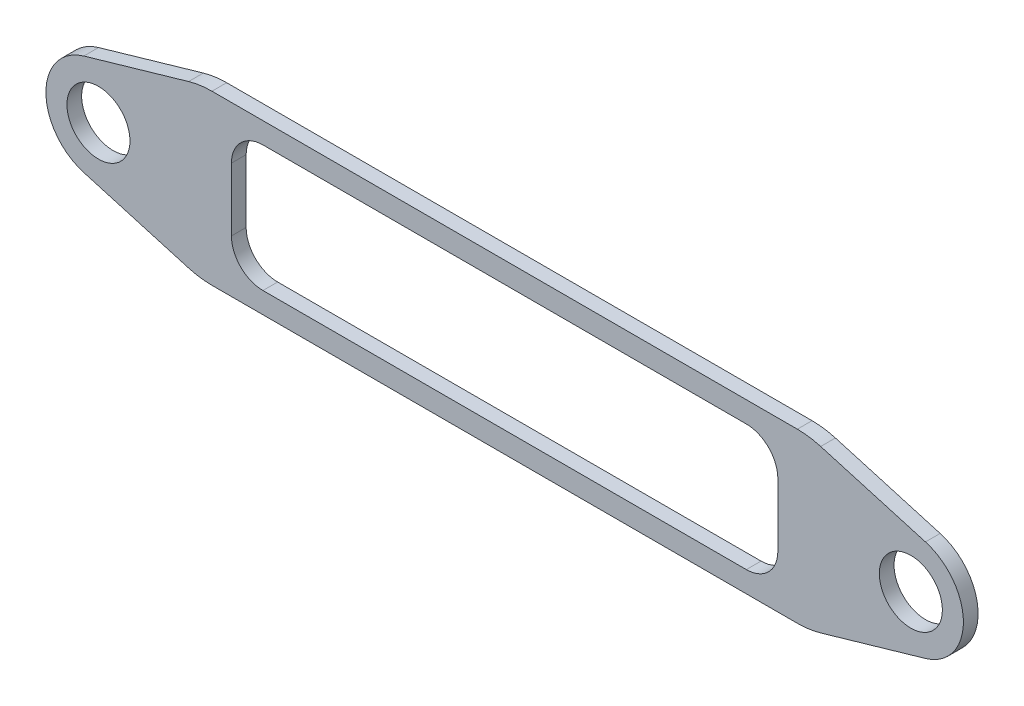
ISO-10303-21;
HEADER;
FILE_DESCRIPTION(('STEP AP214'),'2;1');
FILE_NAME('part.step','',(''),(''),'','','');
FILE_SCHEMA(('AUTOMOTIVE_DESIGN { 1 0 10303 214 1 1 1 1 }'));
ENDSEC;
DATA;
#1=APPLICATION_CONTEXT('core data for automotive mechanical design processes');
#2=APPLICATION_PROTOCOL_DEFINITION('international standard','automotive_design',2000,#1);
#3=PRODUCT_CONTEXT('',#1,'mechanical');
#4=PRODUCT('Part','Part','',(#3));
#5=PRODUCT_RELATED_PRODUCT_CATEGORY('part','',(#4));
#6=PRODUCT_DEFINITION_FORMATION('','',#4);
#7=PRODUCT_DEFINITION_CONTEXT('part definition',#1,'design');
#8=PRODUCT_DEFINITION('design','',#6,#7);
#9=PRODUCT_DEFINITION_SHAPE('','',#8);
#10=(LENGTH_UNIT() NAMED_UNIT(*) SI_UNIT(.MILLI.,.METRE.));
#11=(NAMED_UNIT(*) PLANE_ANGLE_UNIT() SI_UNIT($,.RADIAN.));
#12=(NAMED_UNIT(*) SI_UNIT($,.STERADIAN.) SOLID_ANGLE_UNIT());
#13=UNCERTAINTY_MEASURE_WITH_UNIT(LENGTH_MEASURE(1.E-05),#10,'distance_accuracy_value','');
#14=(GEOMETRIC_REPRESENTATION_CONTEXT(3) GLOBAL_UNCERTAINTY_ASSIGNED_CONTEXT((#13)) GLOBAL_UNIT_ASSIGNED_CONTEXT((#10,
#11,#12)) REPRESENTATION_CONTEXT('',''));
#15=CARTESIAN_POINT('',(0.,0.,0.));
#16=DIRECTION('',(0.,0.,1.));
#17=DIRECTION('',(1.,0.,0.));
#18=AXIS2_PLACEMENT_3D('',#15,#16,#17);
#19=CARTESIAN_POINT('',(-5.81483327501989,0.143638521155481,0.35));
#20=DIRECTION('',(0.,0.,1.));
#21=DIRECTION('',(1.,0.,0.));
#22=AXIS2_PLACEMENT_3D('',#19,#20,#21);
#23=PLANE('',#22);
#24=CARTESIAN_POINT('',(-8.51520834122276,0.143638521155474,0.35));
#25=DIRECTION('',(0.,0.,1.));
#26=DIRECTION('',(1.,0.,0.));
#27=AXIS2_PLACEMENT_3D('',#24,#25,#26);
#28=CIRCLE('',#27,0.749999999999999);
#29=CARTESIAN_POINT('',(-7.76520834122276,0.143638521155474,0.35));
#30=VERTEX_POINT('',#29);
#31=EDGE_CURVE('E227',#30,#30,#28,.T.);
#32=ORIENTED_EDGE('',*,*,#31,.F.);
#33=EDGE_LOOP('',(#32));
#34=FACE_BOUND('',#33,.T.);
#35=CARTESIAN_POINT('',(-5.81483327501989,0.143638521155481,0.35));
#36=DIRECTION('',(0.,0.,1.));
#37=DIRECTION('',(1.,0.,0.));
#38=AXIS2_PLACEMENT_3D('',#35,#36,#37);
#39=CIRCLE('',#38,2.);
#40=CARTESIAN_POINT('',(-6.37031166717866,-1.7776745079589,0.35));
#41=VERTEX_POINT('',#40);
#42=CARTESIAN_POINT('',(-5.81483327501988,-1.85636147884453,0.35));
#43=VERTEX_POINT('',#42);
#44=EDGE_CURVE('E271',#41,#43,#39,.T.);
#45=ORIENTED_EDGE('',*,*,#44,.T.);
#46=DIRECTION('',(1.,0.,0.));
#47=VECTOR('',#46,1.);
#48=CARTESIAN_POINT('',(-5.81483327501988,-1.85636147884453,0.35));
#49=LINE('',#48,#47);
#50=CARTESIAN_POINT('',(8.1130496135076,-1.85636147884452,0.35));
#51=VERTEX_POINT('',#50);
#52=EDGE_CURVE('E275',#43,#51,#49,.T.);
#53=ORIENTED_EDGE('',*,*,#52,.T.);
#54=CARTESIAN_POINT('',(8.1130496135076,0.143638521155474,0.35));
#55=DIRECTION('',(0.,0.,1.));
#56=DIRECTION('',(1.,0.,0.));
#57=AXIS2_PLACEMENT_3D('',#54,#55,#56);
#58=CIRCLE('',#57,2.);
#59=CARTESIAN_POINT('',(8.66852800566637,-1.77767450795891,0.35));
#60=VERTEX_POINT('',#59);
#61=EDGE_CURVE('E279',#51,#60,#58,.T.);
#62=ORIENTED_EDGE('',*,*,#61,.T.);
#63=DIRECTION('',(0.960656514557194,0.277739196079387,0.));
#64=VECTOR('',#63,1.);
#65=CARTESIAN_POINT('',(8.66852800566637,-1.77767450795891,0.35));
#66=LINE('',#65,#64);
#67=CARTESIAN_POINT('',(11.1605986748097,-1.05718212204101,0.35));
#68=VERTEX_POINT('',#67);
#69=EDGE_CURVE('E282',#60,#68,#66,.T.);
#70=ORIENTED_EDGE('',*,*,#69,.T.);
#71=CARTESIAN_POINT('',(10.8134246797105,0.143638521155467,0.35));
#72=DIRECTION('',(0.,0.,1.));
#73=DIRECTION('',(1.,0.,0.));
#74=AXIS2_PLACEMENT_3D('',#71,#72,#73);
#75=CIRCLE('',#74,1.24999999999998);
#76=CARTESIAN_POINT('',(11.1605986748097,1.34445916435195,0.35));
#77=VERTEX_POINT('',#76);
#78=EDGE_CURVE('E285',#68,#77,#75,.T.);
#79=ORIENTED_EDGE('',*,*,#78,.T.);
#80=DIRECTION('',(-0.960656514557193,0.27773919607939,0.));
#81=VECTOR('',#80,1.);
#82=CARTESIAN_POINT('',(11.1605986748097,1.34445916435195,0.35));
#83=LINE('',#82,#81);
#84=CARTESIAN_POINT('',(8.66852800566637,2.06495155026986,0.35));
#85=VERTEX_POINT('',#84);
#86=EDGE_CURVE('E288',#77,#85,#83,.T.);
#87=ORIENTED_EDGE('',*,*,#86,.T.);
#88=CARTESIAN_POINT('',(8.1130496135076,0.143638521155474,0.35));
#89=DIRECTION('',(0.,0.,1.));
#90=DIRECTION('',(1.,0.,0.));
#91=AXIS2_PLACEMENT_3D('',#88,#89,#90);
#92=CIRCLE('',#91,2.);
#93=CARTESIAN_POINT('',(8.1130496135076,2.14363852115547,0.35));
#94=VERTEX_POINT('',#93);
#95=EDGE_CURVE('E291',#85,#94,#92,.T.);
#96=ORIENTED_EDGE('',*,*,#95,.T.);
#97=DIRECTION('',(-1.,0.,0.));
#98=VECTOR('',#97,1.);
#99=CARTESIAN_POINT('',(8.1130496135076,2.14363852115547,0.35));
#100=LINE('',#99,#98);
#101=CARTESIAN_POINT('',(-5.81483327501988,2.14363852115548,0.35));
#102=VERTEX_POINT('',#101);
#103=EDGE_CURVE('E294',#94,#102,#100,.T.);
#104=ORIENTED_EDGE('',*,*,#103,.T.);
#105=CARTESIAN_POINT('',(-5.81483327501989,0.143638521155481,0.35));
#106=DIRECTION('',(0.,0.,1.));
#107=DIRECTION('',(1.,0.,0.));
#108=AXIS2_PLACEMENT_3D('',#105,#106,#107);
#109=CIRCLE('',#108,2.);
#110=CARTESIAN_POINT('',(-6.37031166717866,2.06495155026987,0.35));
#111=VERTEX_POINT('',#110);
#112=EDGE_CURVE('E297',#102,#111,#109,.T.);
#113=ORIENTED_EDGE('',*,*,#112,.T.);
#114=DIRECTION('',(-0.960656514557193,-0.277739196079388,0.));
#115=VECTOR('',#114,1.);
#116=CARTESIAN_POINT('',(-6.37031166717866,2.06495155026987,0.35));
#117=LINE('',#116,#115);
#118=CARTESIAN_POINT('',(-8.86238233632199,1.34445916435196,0.35));
#119=VERTEX_POINT('',#118);
#120=EDGE_CURVE('E300',#111,#119,#117,.T.);
#121=ORIENTED_EDGE('',*,*,#120,.T.);
#122=CARTESIAN_POINT('',(-8.51520834122276,0.143638521155474,0.35));
#123=DIRECTION('',(0.,0.,1.));
#124=DIRECTION('',(1.,0.,0.));
#125=AXIS2_PLACEMENT_3D('',#122,#123,#124);
#126=CIRCLE('',#125,1.24999999999999);
#127=CARTESIAN_POINT('',(-8.86238233632199,-1.05718212204101,0.35));
#128=VERTEX_POINT('',#127);
#129=EDGE_CURVE('E303',#119,#128,#126,.T.);
#130=ORIENTED_EDGE('',*,*,#129,.T.);
#131=DIRECTION('',(0.960656514557194,-0.277739196079385,0.));
#132=VECTOR('',#131,1.);
#133=CARTESIAN_POINT('',(-8.86238233632199,-1.05718212204101,0.35));
#134=LINE('',#133,#132);
#135=EDGE_CURVE('E306',#128,#41,#134,.T.);
#136=ORIENTED_EDGE('',*,*,#135,.T.);
#137=EDGE_LOOP('',(#45,#53,#62,#70,#79,#87,#96,#104,#113,#121,#130,#136));
#138=FACE_BOUND('',#137,.T.);
#139=DIRECTION('',(0.,1.,0.));
#140=VECTOR('',#139,1.);
#141=CARTESIAN_POINT('',(7.64910816924386,-0.606361478844519,0.35));
#142=LINE('',#141,#140);
#143=CARTESIAN_POINT('',(7.64910816924386,-0.606361478844519,0.35));
#144=VERTEX_POINT('',#143);
#145=CARTESIAN_POINT('',(7.64910816924386,0.893638521155475,0.35));
#146=VERTEX_POINT('',#145);
#147=EDGE_CURVE('E188',#144,#146,#142,.T.);
#148=ORIENTED_EDGE('',*,*,#147,.F.);
#149=CARTESIAN_POINT('',(6.89910816924386,-0.606361478844519,0.35));
#150=DIRECTION('',(0.,0.,1.));
#151=DIRECTION('',(1.,0.,0.));
#152=AXIS2_PLACEMENT_3D('',#149,#150,#151);
#153=CIRCLE('',#152,0.749999999999997);
#154=CARTESIAN_POINT('',(6.89910816924386,-1.35636147884452,0.35));
#155=VERTEX_POINT('',#154);
#156=EDGE_CURVE('E179',#155,#144,#153,.T.);
#157=ORIENTED_EDGE('',*,*,#156,.F.);
#158=DIRECTION('',(1.,0.,0.));
#159=VECTOR('',#158,1.);
#160=CARTESIAN_POINT('',(-4.60089183075614,-1.35636147884452,0.35));
#161=LINE('',#160,#159);
#162=CARTESIAN_POINT('',(-4.60089183075614,-1.35636147884452,0.35));
#163=VERTEX_POINT('',#162);
#164=EDGE_CURVE('E222',#163,#155,#161,.T.);
#165=ORIENTED_EDGE('',*,*,#164,.F.);
#166=CARTESIAN_POINT('',(-4.60089183075614,-0.606361478844519,0.35));
#167=DIRECTION('',(0.,0.,1.));
#168=DIRECTION('',(1.,0.,0.));
#169=AXIS2_PLACEMENT_3D('',#166,#167,#168);
#170=CIRCLE('',#169,0.750000000000001);
#171=CARTESIAN_POINT('',(-5.35089183075614,-0.606361478844519,0.35));
#172=VERTEX_POINT('',#171);
#173=EDGE_CURVE('E219',#172,#163,#170,.T.);
#174=ORIENTED_EDGE('',*,*,#173,.F.);
#175=DIRECTION('',(0.,-1.,0.));
#176=VECTOR('',#175,1.);
#177=CARTESIAN_POINT('',(-5.35089183075614,0.893638521155475,0.35));
#178=LINE('',#177,#176);
#179=CARTESIAN_POINT('',(-5.35089183075614,0.893638521155475,0.35));
#180=VERTEX_POINT('',#179);
#181=EDGE_CURVE('E216',#180,#172,#178,.T.);
#182=ORIENTED_EDGE('',*,*,#181,.F.);
#183=CARTESIAN_POINT('',(-4.60089183075614,0.893638521155475,0.35));
#184=DIRECTION('',(0.,0.,1.));
#185=DIRECTION('',(1.,0.,0.));
#186=AXIS2_PLACEMENT_3D('',#183,#184,#185);
#187=CIRCLE('',#186,0.750000000000001);
#188=CARTESIAN_POINT('',(-4.60089183075614,1.64363852115548,0.35));
#189=VERTEX_POINT('',#188);
#190=EDGE_CURVE('E213',#189,#180,#187,.T.);
#191=ORIENTED_EDGE('',*,*,#190,.F.);
#192=DIRECTION('',(-1.,0.,0.));
#193=VECTOR('',#192,1.);
#194=CARTESIAN_POINT('',(6.89910816924386,1.64363852115548,0.35));
#195=LINE('',#194,#193);
#196=CARTESIAN_POINT('',(6.89910816924386,1.64363852115548,0.35));
#197=VERTEX_POINT('',#196);
#198=EDGE_CURVE('E207',#197,#189,#195,.T.);
#199=ORIENTED_EDGE('',*,*,#198,.F.);
#200=CARTESIAN_POINT('',(6.89910816924386,0.893638521155475,0.35));
#201=DIRECTION('',(0.,0.,1.));
#202=DIRECTION('',(1.,0.,0.));
#203=AXIS2_PLACEMENT_3D('',#200,#201,#202);
#204=CIRCLE('',#203,0.750000000000001);
#205=EDGE_CURVE('E203',#146,#197,#204,.T.);
#206=ORIENTED_EDGE('',*,*,#205,.F.);
#207=EDGE_LOOP('',(#148,#157,#165,#174,#182,#191,#199,#206));
#208=FACE_BOUND('',#207,.T.);
#209=CARTESIAN_POINT('',(10.8134246797105,0.143638521155481,0.35));
#210=DIRECTION('',(0.,0.,1.));
#211=DIRECTION('',(1.,0.,0.));
#212=AXIS2_PLACEMENT_3D('',#209,#210,#211);
#213=CIRCLE('',#212,0.749999999999999);
#214=CARTESIAN_POINT('',(11.5634246797105,0.143638521155481,0.35));
#215=VERTEX_POINT('',#214);
#216=EDGE_CURVE('E656',#215,#215,#213,.T.);
#217=ORIENTED_EDGE('',*,*,#216,.F.);
#218=EDGE_LOOP('',(#217));
#219=FACE_BOUND('',#218,.T.);
#220=ADVANCED_FACE('F41',(#34,#138,#208,#219),#23,.T.);
#221=CARTESIAN_POINT('',(-5.81483327501989,0.143638521155481,0.));
#222=DIRECTION('',(0.,0.,1.));
#223=DIRECTION('',(1.,0.,0.));
#224=AXIS2_PLACEMENT_3D('',#221,#222,#223);
#225=PLANE('',#224);
#226=CARTESIAN_POINT('',(-5.81483327501989,0.143638521155481,0.));
#227=DIRECTION('',(0.,0.,1.));
#228=DIRECTION('',(1.,0.,0.));
#229=AXIS2_PLACEMENT_3D('',#226,#227,#228);
#230=CIRCLE('',#229,2.);
#231=CARTESIAN_POINT('',(-6.37031166717866,-1.7776745079589,0.));
#232=VERTEX_POINT('',#231);
#233=CARTESIAN_POINT('',(-5.81483327501988,-1.85636147884453,0.));
#234=VERTEX_POINT('',#233);
#235=EDGE_CURVE('E197',#232,#234,#230,.T.);
#236=ORIENTED_EDGE('',*,*,#235,.F.);
#237=DIRECTION('',(0.960656514557194,-0.277739196079385,0.));
#238=VECTOR('',#237,1.);
#239=CARTESIAN_POINT('',(-8.86238233632199,-1.05718212204101,0.));
#240=LINE('',#239,#238);
#241=CARTESIAN_POINT('',(-8.86238233632199,-1.05718212204101,0.));
#242=VERTEX_POINT('',#241);
#243=EDGE_CURVE('E276',#242,#232,#240,.T.);
#244=ORIENTED_EDGE('',*,*,#243,.F.);
#245=CARTESIAN_POINT('',(-8.51520834122276,0.143638521155474,0.));
#246=DIRECTION('',(0.,0.,1.));
#247=DIRECTION('',(1.,0.,0.));
#248=AXIS2_PLACEMENT_3D('',#245,#246,#247);
#249=CIRCLE('',#248,1.24999999999999);
#250=CARTESIAN_POINT('',(-8.86238233632199,1.34445916435196,0.));
#251=VERTEX_POINT('',#250);
#252=EDGE_CURVE('E340',#251,#242,#249,.T.);
#253=ORIENTED_EDGE('',*,*,#252,.F.);
#254=DIRECTION('',(-0.960656514557193,-0.277739196079388,0.));
#255=VECTOR('',#254,1.);
#256=CARTESIAN_POINT('',(-6.37031166717866,2.06495155026987,0.));
#257=LINE('',#256,#255);
#258=CARTESIAN_POINT('',(-6.37031166717866,2.06495155026987,0.));
#259=VERTEX_POINT('',#258);
#260=EDGE_CURVE('E337',#259,#251,#257,.T.);
#261=ORIENTED_EDGE('',*,*,#260,.F.);
#262=CARTESIAN_POINT('',(-5.81483327501989,0.143638521155481,0.));
#263=DIRECTION('',(0.,0.,1.));
#264=DIRECTION('',(1.,0.,0.));
#265=AXIS2_PLACEMENT_3D('',#262,#263,#264);
#266=CIRCLE('',#265,2.);
#267=CARTESIAN_POINT('',(-5.81483327501988,2.14363852115548,0.));
#268=VERTEX_POINT('',#267);
#269=EDGE_CURVE('E334',#268,#259,#266,.T.);
#270=ORIENTED_EDGE('',*,*,#269,.F.);
#271=DIRECTION('',(-1.,0.,0.));
#272=VECTOR('',#271,1.);
#273=CARTESIAN_POINT('',(8.1130496135076,2.14363852115547,0.));
#274=LINE('',#273,#272);
#275=CARTESIAN_POINT('',(8.1130496135076,2.14363852115547,0.));
#276=VERTEX_POINT('',#275);
#277=EDGE_CURVE('E331',#276,#268,#274,.T.);
#278=ORIENTED_EDGE('',*,*,#277,.F.);
#279=CARTESIAN_POINT('',(8.1130496135076,0.143638521155474,0.));
#280=DIRECTION('',(0.,0.,1.));
#281=DIRECTION('',(1.,0.,0.));
#282=AXIS2_PLACEMENT_3D('',#279,#280,#281);
#283=CIRCLE('',#282,2.);
#284=CARTESIAN_POINT('',(8.66852800566637,2.06495155026986,0.));
#285=VERTEX_POINT('',#284);
#286=EDGE_CURVE('E328',#285,#276,#283,.T.);
#287=ORIENTED_EDGE('',*,*,#286,.F.);
#288=DIRECTION('',(-0.960656514557193,0.27773919607939,0.));
#289=VECTOR('',#288,1.);
#290=CARTESIAN_POINT('',(11.1605986748097,1.34445916435195,0.));
#291=LINE('',#290,#289);
#292=CARTESIAN_POINT('',(11.1605986748097,1.34445916435195,0.));
#293=VERTEX_POINT('',#292);
#294=EDGE_CURVE('E325',#293,#285,#291,.T.);
#295=ORIENTED_EDGE('',*,*,#294,.F.);
#296=CARTESIAN_POINT('',(10.8134246797105,0.143638521155467,0.));
#297=DIRECTION('',(0.,0.,1.));
#298=DIRECTION('',(1.,0.,0.));
#299=AXIS2_PLACEMENT_3D('',#296,#297,#298);
#300=CIRCLE('',#299,1.24999999999998);
#301=CARTESIAN_POINT('',(11.1605986748097,-1.05718212204101,0.));
#302=VERTEX_POINT('',#301);
#303=EDGE_CURVE('E322',#302,#293,#300,.T.);
#304=ORIENTED_EDGE('',*,*,#303,.F.);
#305=DIRECTION('',(0.960656514557194,0.277739196079387,0.));
#306=VECTOR('',#305,1.);
#307=CARTESIAN_POINT('',(8.66852800566637,-1.77767450795891,0.));
#308=LINE('',#307,#306);
#309=CARTESIAN_POINT('',(8.66852800566637,-1.77767450795891,0.));
#310=VERTEX_POINT('',#309);
#311=EDGE_CURVE('E319',#310,#302,#308,.T.);
#312=ORIENTED_EDGE('',*,*,#311,.F.);
#313=CARTESIAN_POINT('',(8.1130496135076,0.143638521155474,0.));
#314=DIRECTION('',(0.,0.,1.));
#315=DIRECTION('',(1.,0.,0.));
#316=AXIS2_PLACEMENT_3D('',#313,#314,#315);
#317=CIRCLE('',#316,2.);
#318=CARTESIAN_POINT('',(8.1130496135076,-1.85636147884452,0.));
#319=VERTEX_POINT('',#318);
#320=EDGE_CURVE('E316',#319,#310,#317,.T.);
#321=ORIENTED_EDGE('',*,*,#320,.F.);
#322=DIRECTION('',(1.,0.,0.));
#323=VECTOR('',#322,1.);
#324=CARTESIAN_POINT('',(-5.81483327501988,-1.85636147884453,0.));
#325=LINE('',#324,#323);
#326=EDGE_CURVE('E313',#234,#319,#325,.T.);
#327=ORIENTED_EDGE('',*,*,#326,.F.);
#328=EDGE_LOOP('',(#236,#244,#253,#261,#270,#278,#287,#295,#304,#312,#321,#327));
#329=FACE_BOUND('',#328,.T.);
#330=CARTESIAN_POINT('',(6.89910816924386,-0.606361478844519,0.));
#331=DIRECTION('',(0.,0.,1.));
#332=DIRECTION('',(1.,0.,0.));
#333=AXIS2_PLACEMENT_3D('',#330,#331,#332);
#334=CIRCLE('',#333,0.749999999999997);
#335=CARTESIAN_POINT('',(6.89910816924386,-1.35636147884452,0.));
#336=VERTEX_POINT('',#335);
#337=CARTESIAN_POINT('',(7.64910816924386,-0.606361478844519,0.));
#338=VERTEX_POINT('',#337);
#339=EDGE_CURVE('E65',#336,#338,#334,.T.);
#340=ORIENTED_EDGE('',*,*,#339,.T.);
#341=DIRECTION('',(0.,1.,0.));
#342=VECTOR('',#341,1.);
#343=CARTESIAN_POINT('',(7.64910816924386,-0.606361478844519,0.));
#344=LINE('',#343,#342);
#345=CARTESIAN_POINT('',(7.64910816924386,0.893638521155475,0.));
#346=VERTEX_POINT('',#345);
#347=EDGE_CURVE('E195',#338,#346,#344,.T.);
#348=ORIENTED_EDGE('',*,*,#347,.T.);
#349=CARTESIAN_POINT('',(6.89910816924386,0.893638521155475,0.));
#350=DIRECTION('',(0.,0.,1.));
#351=DIRECTION('',(1.,0.,0.));
#352=AXIS2_PLACEMENT_3D('',#349,#350,#351);
#353=CIRCLE('',#352,0.750000000000001);
#354=CARTESIAN_POINT('',(6.89910816924386,1.64363852115548,0.));
#355=VERTEX_POINT('',#354);
#356=EDGE_CURVE('E230',#346,#355,#353,.T.);
#357=ORIENTED_EDGE('',*,*,#356,.T.);
#358=DIRECTION('',(-1.,0.,0.));
#359=VECTOR('',#358,1.);
#360=CARTESIAN_POINT('',(6.89910816924386,1.64363852115548,0.));
#361=LINE('',#360,#359);
#362=CARTESIAN_POINT('',(-4.60089183075614,1.64363852115548,0.));
#363=VERTEX_POINT('',#362);
#364=EDGE_CURVE('E234',#355,#363,#361,.T.);
#365=ORIENTED_EDGE('',*,*,#364,.T.);
#366=CARTESIAN_POINT('',(-4.60089183075614,0.893638521155475,0.));
#367=DIRECTION('',(0.,0.,1.));
#368=DIRECTION('',(1.,0.,0.));
#369=AXIS2_PLACEMENT_3D('',#366,#367,#368);
#370=CIRCLE('',#369,0.750000000000001);
#371=CARTESIAN_POINT('',(-5.35089183075614,0.893638521155475,0.));
#372=VERTEX_POINT('',#371);
#373=EDGE_CURVE('E238',#363,#372,#370,.T.);
#374=ORIENTED_EDGE('',*,*,#373,.T.);
#375=DIRECTION('',(0.,-1.,0.));
#376=VECTOR('',#375,1.);
#377=CARTESIAN_POINT('',(-5.35089183075614,0.893638521155475,0.));
#378=LINE('',#377,#376);
#379=CARTESIAN_POINT('',(-5.35089183075614,-0.606361478844519,0.));
#380=VERTEX_POINT('',#379);
#381=EDGE_CURVE('E242',#372,#380,#378,.T.);
#382=ORIENTED_EDGE('',*,*,#381,.T.);
#383=CARTESIAN_POINT('',(-4.60089183075614,-0.606361478844519,0.));
#384=DIRECTION('',(0.,0.,1.));
#385=DIRECTION('',(1.,0.,0.));
#386=AXIS2_PLACEMENT_3D('',#383,#384,#385);
#387=CIRCLE('',#386,0.750000000000001);
#388=CARTESIAN_POINT('',(-4.60089183075614,-1.35636147884452,0.));
#389=VERTEX_POINT('',#388);
#390=EDGE_CURVE('E246',#380,#389,#387,.T.);
#391=ORIENTED_EDGE('',*,*,#390,.T.);
#392=DIRECTION('',(1.,0.,0.));
#393=VECTOR('',#392,1.);
#394=CARTESIAN_POINT('',(-4.60089183075614,-1.35636147884452,0.));
#395=LINE('',#394,#393);
#396=EDGE_CURVE('E189',#389,#336,#395,.T.);
#397=ORIENTED_EDGE('',*,*,#396,.T.);
#398=EDGE_LOOP('',(#340,#348,#357,#365,#374,#382,#391,#397));
#399=FACE_BOUND('',#398,.T.);
#400=CARTESIAN_POINT('',(-8.51520834122276,0.143638521155474,0.));
#401=DIRECTION('',(0.,0.,1.));
#402=DIRECTION('',(1.,0.,0.));
#403=AXIS2_PLACEMENT_3D('',#400,#401,#402);
#404=CIRCLE('',#403,0.749999999999999);
#405=CARTESIAN_POINT('',(-7.76520834122276,0.143638521155474,0.));
#406=VERTEX_POINT('',#405);
#407=EDGE_CURVE('E664',#406,#406,#404,.T.);
#408=ORIENTED_EDGE('',*,*,#407,.T.);
#409=EDGE_LOOP('',(#408));
#410=FACE_BOUND('',#409,.T.);
#411=CARTESIAN_POINT('',(10.8134246797105,0.143638521155481,0.));
#412=DIRECTION('',(0.,0.,1.));
#413=DIRECTION('',(1.,0.,0.));
#414=AXIS2_PLACEMENT_3D('',#411,#412,#413);
#415=CIRCLE('',#414,0.749999999999999);
#416=CARTESIAN_POINT('',(11.5634246797105,0.143638521155481,0.));
#417=VERTEX_POINT('',#416);
#418=EDGE_CURVE('E659',#417,#417,#415,.T.);
#419=ORIENTED_EDGE('',*,*,#418,.T.);
#420=EDGE_LOOP('',(#419));
#421=FACE_BOUND('',#420,.T.);
#422=ADVANCED_FACE('F395',(#329,#399,#410,#421),#225,.F.);
#423=CARTESIAN_POINT('',(-5.81483327501989,0.143638521155481,0.35));
#424=DIRECTION('',(0.,0.,-1.));
#425=DIRECTION('',(-1.,0.,0.));
#426=AXIS2_PLACEMENT_3D('',#423,#424,#425);
#427=CYLINDRICAL_SURFACE('',#426,2.);
#428=ORIENTED_EDGE('',*,*,#235,.T.);
#429=DIRECTION('',(0.,0.,-1.));
#430=VECTOR('',#429,1.);
#431=CARTESIAN_POINT('',(-5.81483327501988,-1.85636147884453,0.35));
#432=LINE('',#431,#430);
#433=EDGE_CURVE('E11',#43,#234,#432,.T.);
#434=ORIENTED_EDGE('',*,*,#433,.F.);
#435=ORIENTED_EDGE('',*,*,#44,.F.);
#436=DIRECTION('',(0.,0.,-1.));
#437=VECTOR('',#436,1.);
#438=CARTESIAN_POINT('',(-6.37031166717866,-1.7776745079589,0.35));
#439=LINE('',#438,#437);
#440=EDGE_CURVE('E309',#41,#232,#439,.T.);
#441=ORIENTED_EDGE('',*,*,#440,.T.);
#442=EDGE_LOOP('',(#428,#434,#435,#441));
#443=FACE_BOUND('',#442,.T.);
#444=ADVANCED_FACE('F43',(#443),#427,.T.);
#445=CARTESIAN_POINT('',(-5.81483327501988,-1.85636147884453,0.35));
#446=DIRECTION('',(0.,1.,0.));
#447=DIRECTION('',(-1.,0.,0.));
#448=AXIS2_PLACEMENT_3D('',#445,#446,#447);
#449=PLANE('',#448);
#450=ORIENTED_EDGE('',*,*,#326,.T.);
#451=DIRECTION('',(0.,0.,-1.));
#452=VECTOR('',#451,1.);
#453=CARTESIAN_POINT('',(8.1130496135076,-1.85636147884452,0.35));
#454=LINE('',#453,#452);
#455=EDGE_CURVE('E50',#51,#319,#454,.T.);
#456=ORIENTED_EDGE('',*,*,#455,.F.);
#457=ORIENTED_EDGE('',*,*,#52,.F.);
#458=ORIENTED_EDGE('',*,*,#433,.T.);
#459=EDGE_LOOP('',(#450,#456,#457,#458));
#460=FACE_BOUND('',#459,.T.);
#461=ADVANCED_FACE('F412',(#460),#449,.F.);
#462=CARTESIAN_POINT('',(8.1130496135076,0.143638521155474,0.35));
#463=DIRECTION('',(0.,0.,-1.));
#464=DIRECTION('',(-1.,0.,0.));
#465=AXIS2_PLACEMENT_3D('',#462,#463,#464);
#466=CYLINDRICAL_SURFACE('',#465,2.);
#467=ORIENTED_EDGE('',*,*,#320,.T.);
#468=DIRECTION('',(0.,0.,-1.));
#469=VECTOR('',#468,1.);
#470=CARTESIAN_POINT('',(8.66852800566637,-1.77767450795891,0.35));
#471=LINE('',#470,#469);
#472=EDGE_CURVE('E380',#60,#310,#471,.T.);
#473=ORIENTED_EDGE('',*,*,#472,.F.);
#474=ORIENTED_EDGE('',*,*,#61,.F.);
#475=ORIENTED_EDGE('',*,*,#455,.T.);
#476=EDGE_LOOP('',(#467,#473,#474,#475));
#477=FACE_BOUND('',#476,.T.);
#478=ADVANCED_FACE('F389',(#477),#466,.T.);
#479=CARTESIAN_POINT('',(8.66852800566637,-1.77767450795891,0.35));
#480=DIRECTION('',(-0.277739196079387,0.960656514557194,0.));
#481=DIRECTION('',(-0.960656514557194,-0.277739196079387,0.));
#482=AXIS2_PLACEMENT_3D('',#479,#480,#481);
#483=PLANE('',#482);
#484=ORIENTED_EDGE('',*,*,#311,.T.);
#485=DIRECTION('',(0.,0.,-1.));
#486=VECTOR('',#485,1.);
#487=CARTESIAN_POINT('',(11.1605986748097,-1.05718212204101,0.35));
#488=LINE('',#487,#486);
#489=EDGE_CURVE('E376',#68,#302,#488,.T.);
#490=ORIENTED_EDGE('',*,*,#489,.F.);
#491=ORIENTED_EDGE('',*,*,#69,.F.);
#492=ORIENTED_EDGE('',*,*,#472,.T.);
#493=EDGE_LOOP('',(#484,#490,#491,#492));
#494=FACE_BOUND('',#493,.T.);
#495=ADVANCED_FACE('F401',(#494),#483,.F.);
#496=CARTESIAN_POINT('',(10.8134246797105,0.143638521155467,0.35));
#497=DIRECTION('',(0.,0.,-1.));
#498=DIRECTION('',(-1.,0.,0.));
#499=AXIS2_PLACEMENT_3D('',#496,#497,#498);
#500=CYLINDRICAL_SURFACE('',#499,1.24999999999998);
#501=ORIENTED_EDGE('',*,*,#303,.T.);
#502=DIRECTION('',(0.,0.,-1.));
#503=VECTOR('',#502,1.);
#504=CARTESIAN_POINT('',(11.1605986748097,1.34445916435195,0.35));
#505=LINE('',#504,#503);
#506=EDGE_CURVE('E372',#77,#293,#505,.T.);
#507=ORIENTED_EDGE('',*,*,#506,.F.);
#508=ORIENTED_EDGE('',*,*,#78,.F.);
#509=ORIENTED_EDGE('',*,*,#489,.T.);
#510=EDGE_LOOP('',(#501,#507,#508,#509));
#511=FACE_BOUND('',#510,.T.);
#512=ADVANCED_FACE('F405',(#511),#500,.T.);
#513=CARTESIAN_POINT('',(11.1605986748097,1.34445916435195,0.35));
#514=DIRECTION('',(-0.27773919607939,-0.960656514557193,0.));
#515=DIRECTION('',(0.960656514557193,-0.27773919607939,0.));
#516=AXIS2_PLACEMENT_3D('',#513,#514,#515);
#517=PLANE('',#516);
#518=ORIENTED_EDGE('',*,*,#294,.T.);
#519=DIRECTION('',(0.,0.,-1.));
#520=VECTOR('',#519,1.);
#521=CARTESIAN_POINT('',(8.66852800566637,2.06495155026986,0.35));
#522=LINE('',#521,#520);
#523=EDGE_CURVE('E368',#85,#285,#522,.T.);
#524=ORIENTED_EDGE('',*,*,#523,.F.);
#525=ORIENTED_EDGE('',*,*,#86,.F.);
#526=ORIENTED_EDGE('',*,*,#506,.T.);
#527=EDGE_LOOP('',(#518,#524,#525,#526));
#528=FACE_BOUND('',#527,.T.);
#529=ADVANCED_FACE('F445',(#528),#517,.F.);
#530=CARTESIAN_POINT('',(8.1130496135076,0.143638521155474,0.35));
#531=DIRECTION('',(0.,0.,-1.));
#532=DIRECTION('',(-1.,0.,0.));
#533=AXIS2_PLACEMENT_3D('',#530,#531,#532);
#534=CYLINDRICAL_SURFACE('',#533,2.);
#535=ORIENTED_EDGE('',*,*,#286,.T.);
#536=DIRECTION('',(0.,0.,-1.));
#537=VECTOR('',#536,1.);
#538=CARTESIAN_POINT('',(8.1130496135076,2.14363852115547,0.35));
#539=LINE('',#538,#537);
#540=EDGE_CURVE('E364',#94,#276,#539,.T.);
#541=ORIENTED_EDGE('',*,*,#540,.F.);
#542=ORIENTED_EDGE('',*,*,#95,.F.);
#543=ORIENTED_EDGE('',*,*,#523,.T.);
#544=EDGE_LOOP('',(#535,#541,#542,#543));
#545=FACE_BOUND('',#544,.T.);
#546=ADVANCED_FACE('F443',(#545),#534,.T.);
#547=CARTESIAN_POINT('',(8.1130496135076,2.14363852115547,0.35));
#548=DIRECTION('',(0.,-1.,0.));
#549=DIRECTION('',(1.,0.,0.));
#550=AXIS2_PLACEMENT_3D('',#547,#548,#549);
#551=PLANE('',#550);
#552=ORIENTED_EDGE('',*,*,#277,.T.);
#553=DIRECTION('',(0.,0.,-1.));
#554=VECTOR('',#553,1.);
#555=CARTESIAN_POINT('',(-5.81483327501988,2.14363852115548,0.35));
#556=LINE('',#555,#554);
#557=EDGE_CURVE('E360',#102,#268,#556,.T.);
#558=ORIENTED_EDGE('',*,*,#557,.F.);
#559=ORIENTED_EDGE('',*,*,#103,.F.);
#560=ORIENTED_EDGE('',*,*,#540,.T.);
#561=EDGE_LOOP('',(#552,#558,#559,#560));
#562=FACE_BOUND('',#561,.T.);
#563=ADVANCED_FACE('F439',(#562),#551,.F.);
#564=CARTESIAN_POINT('',(-5.81483327501989,0.143638521155481,0.35));
#565=DIRECTION('',(0.,0.,-1.));
#566=DIRECTION('',(-1.,0.,0.));
#567=AXIS2_PLACEMENT_3D('',#564,#565,#566);
#568=CYLINDRICAL_SURFACE('',#567,2.);
#569=ORIENTED_EDGE('',*,*,#269,.T.);
#570=DIRECTION('',(0.,0.,-1.));
#571=VECTOR('',#570,1.);
#572=CARTESIAN_POINT('',(-6.37031166717866,2.06495155026987,0.35));
#573=LINE('',#572,#571);
#574=EDGE_CURVE('E356',#111,#259,#573,.T.);
#575=ORIENTED_EDGE('',*,*,#574,.F.);
#576=ORIENTED_EDGE('',*,*,#112,.F.);
#577=ORIENTED_EDGE('',*,*,#557,.T.);
#578=EDGE_LOOP('',(#569,#575,#576,#577));
#579=FACE_BOUND('',#578,.T.);
#580=ADVANCED_FACE('F434',(#579),#568,.T.);
#581=CARTESIAN_POINT('',(-6.37031166717866,2.06495155026987,0.35));
#582=DIRECTION('',(0.277739196079388,-0.960656514557194,0.));
#583=DIRECTION('',(0.960656514557194,0.277739196079388,0.));
#584=AXIS2_PLACEMENT_3D('',#581,#582,#583);
#585=PLANE('',#584);
#586=ORIENTED_EDGE('',*,*,#260,.T.);
#587=DIRECTION('',(0.,0.,-1.));
#588=VECTOR('',#587,1.);
#589=CARTESIAN_POINT('',(-8.86238233632199,1.34445916435196,0.35));
#590=LINE('',#589,#588);
#591=EDGE_CURVE('E352',#119,#251,#590,.T.);
#592=ORIENTED_EDGE('',*,*,#591,.F.);
#593=ORIENTED_EDGE('',*,*,#120,.F.);
#594=ORIENTED_EDGE('',*,*,#574,.T.);
#595=EDGE_LOOP('',(#586,#592,#593,#594));
#596=FACE_BOUND('',#595,.T.);
#597=ADVANCED_FACE('F428',(#596),#585,.F.);
#598=CARTESIAN_POINT('',(-8.51520834122276,0.143638521155474,0.35));
#599=DIRECTION('',(0.,0.,-1.));
#600=DIRECTION('',(-1.,0.,0.));
#601=AXIS2_PLACEMENT_3D('',#598,#599,#600);
#602=CYLINDRICAL_SURFACE('',#601,1.24999999999999);
#603=ORIENTED_EDGE('',*,*,#252,.T.);
#604=DIRECTION('',(0.,0.,-1.));
#605=VECTOR('',#604,1.);
#606=CARTESIAN_POINT('',(-8.86238233632199,-1.05718212204101,0.35));
#607=LINE('',#606,#605);
#608=EDGE_CURVE('E348',#128,#242,#607,.T.);
#609=ORIENTED_EDGE('',*,*,#608,.F.);
#610=ORIENTED_EDGE('',*,*,#129,.F.);
#611=ORIENTED_EDGE('',*,*,#591,.T.);
#612=EDGE_LOOP('',(#603,#609,#610,#611));
#613=FACE_BOUND('',#612,.T.);
#614=ADVANCED_FACE('F424',(#613),#602,.T.);
#615=CARTESIAN_POINT('',(-8.86238233632199,-1.05718212204101,0.35));
#616=DIRECTION('',(0.277739196079385,0.960656514557194,0.));
#617=DIRECTION('',(-0.960656514557194,0.277739196079385,0.));
#618=AXIS2_PLACEMENT_3D('',#615,#616,#617);
#619=PLANE('',#618);
#620=ORIENTED_EDGE('',*,*,#243,.T.);
#621=ORIENTED_EDGE('',*,*,#440,.F.);
#622=ORIENTED_EDGE('',*,*,#135,.F.);
#623=ORIENTED_EDGE('',*,*,#608,.T.);
#624=EDGE_LOOP('',(#620,#621,#622,#623));
#625=FACE_BOUND('',#624,.T.);
#626=ADVANCED_FACE('F419',(#625),#619,.F.);
#627=CARTESIAN_POINT('',(6.89910816924386,-0.606361478844519,0.35));
#628=DIRECTION('',(0.,0.,-1.));
#629=DIRECTION('',(-1.,0.,0.));
#630=AXIS2_PLACEMENT_3D('',#627,#628,#629);
#631=CYLINDRICAL_SURFACE('',#630,0.749999999999997);
#632=ORIENTED_EDGE('',*,*,#339,.F.);
#633=DIRECTION('',(0.,0.,-1.));
#634=VECTOR('',#633,1.);
#635=CARTESIAN_POINT('',(6.89910816924386,-1.35636147884452,0.35));
#636=LINE('',#635,#634);
#637=EDGE_CURVE('E183',#155,#336,#636,.T.);
#638=ORIENTED_EDGE('',*,*,#637,.F.);
#639=ORIENTED_EDGE('',*,*,#156,.T.);
#640=DIRECTION('',(0.,0.,-1.));
#641=VECTOR('',#640,1.);
#642=CARTESIAN_POINT('',(7.64910816924386,-0.606361478844519,0.35));
#643=LINE('',#642,#641);
#644=EDGE_CURVE('E182',#144,#338,#643,.T.);
#645=ORIENTED_EDGE('',*,*,#644,.T.);
#646=EDGE_LOOP('',(#632,#638,#639,#645));
#647=FACE_BOUND('',#646,.T.);
#648=ADVANCED_FACE('F181',(#647),#631,.F.);
#649=CARTESIAN_POINT('',(7.64910816924386,-0.606361478844519,0.35));
#650=DIRECTION('',(-1.,0.,0.));
#651=DIRECTION('',(0.,0.,1.));
#652=AXIS2_PLACEMENT_3D('',#649,#650,#651);
#653=PLANE('',#652);
#654=ORIENTED_EDGE('',*,*,#347,.F.);
#655=ORIENTED_EDGE('',*,*,#644,.F.);
#656=ORIENTED_EDGE('',*,*,#147,.T.);
#657=DIRECTION('',(0.,0.,-1.));
#658=VECTOR('',#657,1.);
#659=CARTESIAN_POINT('',(7.64910816924386,0.893638521155475,0.35));
#660=LINE('',#659,#658);
#661=EDGE_CURVE('E198',#146,#346,#660,.T.);
#662=ORIENTED_EDGE('',*,*,#661,.T.);
#663=EDGE_LOOP('',(#654,#655,#656,#662));
#664=FACE_BOUND('',#663,.T.);
#665=ADVANCED_FACE('F192',(#664),#653,.T.);
#666=CARTESIAN_POINT('',(6.89910816924386,0.893638521155475,0.35));
#667=DIRECTION('',(0.,0.,-1.));
#668=DIRECTION('',(-1.,0.,0.));
#669=AXIS2_PLACEMENT_3D('',#666,#667,#668);
#670=CYLINDRICAL_SURFACE('',#669,0.750000000000001);
#671=ORIENTED_EDGE('',*,*,#356,.F.);
#672=ORIENTED_EDGE('',*,*,#661,.F.);
#673=ORIENTED_EDGE('',*,*,#205,.T.);
#674=DIRECTION('',(0.,0.,-1.));
#675=VECTOR('',#674,1.);
#676=CARTESIAN_POINT('',(6.89910816924386,1.64363852115548,0.35));
#677=LINE('',#676,#675);
#678=EDGE_CURVE('E266',#197,#355,#677,.T.);
#679=ORIENTED_EDGE('',*,*,#678,.T.);
#680=EDGE_LOOP('',(#671,#672,#673,#679));
#681=FACE_BOUND('',#680,.T.);
#682=ADVANCED_FACE('F505',(#681),#670,.F.);
#683=CARTESIAN_POINT('',(6.89910816924386,1.64363852115548,0.35));
#684=DIRECTION('',(0.,-1.,0.));
#685=DIRECTION('',(0.,0.,-1.));
#686=AXIS2_PLACEMENT_3D('',#683,#684,#685);
#687=PLANE('',#686);
#688=ORIENTED_EDGE('',*,*,#364,.F.);
#689=ORIENTED_EDGE('',*,*,#678,.F.);
#690=ORIENTED_EDGE('',*,*,#198,.T.);
#691=DIRECTION('',(0.,0.,-1.));
#692=VECTOR('',#691,1.);
#693=CARTESIAN_POINT('',(-4.60089183075614,1.64363852115548,0.35));
#694=LINE('',#693,#692);
#695=EDGE_CURVE('E263',#189,#363,#694,.T.);
#696=ORIENTED_EDGE('',*,*,#695,.T.);
#697=EDGE_LOOP('',(#688,#689,#690,#696));
#698=FACE_BOUND('',#697,.T.);
#699=ADVANCED_FACE('F511',(#698),#687,.T.);
#700=CARTESIAN_POINT('',(-4.60089183075614,0.893638521155475,0.35));
#701=DIRECTION('',(0.,0.,-1.));
#702=DIRECTION('',(-1.,0.,0.));
#703=AXIS2_PLACEMENT_3D('',#700,#701,#702);
#704=CYLINDRICAL_SURFACE('',#703,0.750000000000001);
#705=ORIENTED_EDGE('',*,*,#373,.F.);
#706=ORIENTED_EDGE('',*,*,#695,.F.);
#707=ORIENTED_EDGE('',*,*,#190,.T.);
#708=DIRECTION('',(0.,0.,-1.));
#709=VECTOR('',#708,1.);
#710=CARTESIAN_POINT('',(-5.35089183075614,0.893638521155475,0.35));
#711=LINE('',#710,#709);
#712=EDGE_CURVE('E260',#180,#372,#711,.T.);
#713=ORIENTED_EDGE('',*,*,#712,.T.);
#714=EDGE_LOOP('',(#705,#706,#707,#713));
#715=FACE_BOUND('',#714,.T.);
#716=ADVANCED_FACE('F519',(#715),#704,.F.);
#717=CARTESIAN_POINT('',(-5.35089183075614,0.893638521155475,0.35));
#718=DIRECTION('',(1.,0.,0.));
#719=DIRECTION('',(0.,0.,-1.));
#720=AXIS2_PLACEMENT_3D('',#717,#718,#719);
#721=PLANE('',#720);
#722=ORIENTED_EDGE('',*,*,#381,.F.);
#723=ORIENTED_EDGE('',*,*,#712,.F.);
#724=ORIENTED_EDGE('',*,*,#181,.T.);
#725=DIRECTION('',(0.,0.,-1.));
#726=VECTOR('',#725,1.);
#727=CARTESIAN_POINT('',(-5.35089183075614,-0.606361478844519,0.35));
#728=LINE('',#727,#726);
#729=EDGE_CURVE('E257',#172,#380,#728,.T.);
#730=ORIENTED_EDGE('',*,*,#729,.T.);
#731=EDGE_LOOP('',(#722,#723,#724,#730));
#732=FACE_BOUND('',#731,.T.);
#733=ADVANCED_FACE('F527',(#732),#721,.T.);
#734=CARTESIAN_POINT('',(-4.60089183075614,-0.606361478844519,0.35));
#735=DIRECTION('',(0.,0.,-1.));
#736=DIRECTION('',(-1.,0.,0.));
#737=AXIS2_PLACEMENT_3D('',#734,#735,#736);
#738=CYLINDRICAL_SURFACE('',#737,0.750000000000001);
#739=ORIENTED_EDGE('',*,*,#390,.F.);
#740=ORIENTED_EDGE('',*,*,#729,.F.);
#741=ORIENTED_EDGE('',*,*,#173,.T.);
#742=DIRECTION('',(0.,0.,-1.));
#743=VECTOR('',#742,1.);
#744=CARTESIAN_POINT('',(-4.60089183075614,-1.35636147884452,0.35));
#745=LINE('',#744,#743);
#746=EDGE_CURVE('E57',#163,#389,#745,.T.);
#747=ORIENTED_EDGE('',*,*,#746,.T.);
#748=EDGE_LOOP('',(#739,#740,#741,#747));
#749=FACE_BOUND('',#748,.T.);
#750=ADVANCED_FACE('F535',(#749),#738,.F.);
#751=CARTESIAN_POINT('',(-4.60089183075614,-1.35636147884452,0.35));
#752=DIRECTION('',(0.,1.,0.));
#753=DIRECTION('',(0.,0.,1.));
#754=AXIS2_PLACEMENT_3D('',#751,#752,#753);
#755=PLANE('',#754);
#756=ORIENTED_EDGE('',*,*,#396,.F.);
#757=ORIENTED_EDGE('',*,*,#746,.F.);
#758=ORIENTED_EDGE('',*,*,#164,.T.);
#759=ORIENTED_EDGE('',*,*,#637,.T.);
#760=EDGE_LOOP('',(#756,#757,#758,#759));
#761=FACE_BOUND('',#760,.T.);
#762=ADVANCED_FACE('F543',(#761),#755,.T.);
#763=CARTESIAN_POINT('',(-8.51520834122276,0.143638521155474,0.35));
#764=DIRECTION('',(0.,0.,-1.));
#765=DIRECTION('',(-1.,0.,0.));
#766=AXIS2_PLACEMENT_3D('',#763,#764,#765);
#767=CYLINDRICAL_SURFACE('',#766,0.749999999999999);
#768=ORIENTED_EDGE('',*,*,#31,.T.);
#769=EDGE_LOOP('',(#768));
#770=FACE_BOUND('',#769,.T.);
#771=ORIENTED_EDGE('',*,*,#407,.F.);
#772=EDGE_LOOP('',(#771));
#773=FACE_BOUND('',#772,.T.);
#774=ADVANCED_FACE('F551',(#770,#773),#767,.F.);
#775=CARTESIAN_POINT('',(10.8134246797105,0.143638521155481,0.35));
#776=DIRECTION('',(0.,0.,-1.));
#777=DIRECTION('',(-1.,0.,0.));
#778=AXIS2_PLACEMENT_3D('',#775,#776,#777);
#779=CYLINDRICAL_SURFACE('',#778,0.749999999999999);
#780=ORIENTED_EDGE('',*,*,#216,.T.);
#781=EDGE_LOOP('',(#780));
#782=FACE_BOUND('',#781,.T.);
#783=ORIENTED_EDGE('',*,*,#418,.F.);
#784=EDGE_LOOP('',(#783));
#785=FACE_BOUND('',#784,.T.);
#786=ADVANCED_FACE('F558',(#782,#785),#779,.F.);
#787=CLOSED_SHELL('',(#220,#422,#444,#461,#478,#495,#512,#529,#546,#563,#580,#597,#614,#626,
#648,#665,#682,#699,#716,#733,#750,#762,#774,#786));
#788=MANIFOLD_SOLID_BREP('B2',#787);
#789=ADVANCED_BREP_SHAPE_REPRESENTATION('',(#18,#788),#14);
#790=SHAPE_DEFINITION_REPRESENTATION(#9,#789);
ENDSEC;
END-ISO-10303-21;
